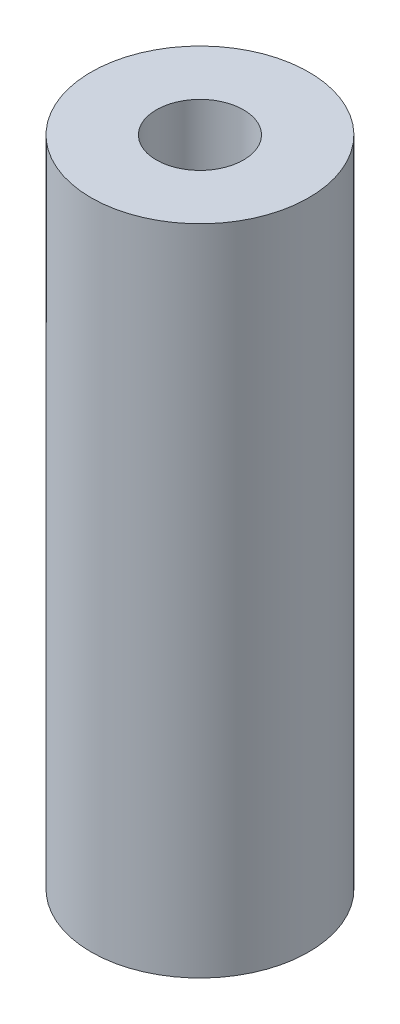
ISO-10303-21;
HEADER;
FILE_DESCRIPTION(('STEP AP214'),'2;1');
FILE_NAME('part.step','',(''),(''),'','','');
FILE_SCHEMA(('AUTOMOTIVE_DESIGN { 1 0 10303 214 1 1 1 1 }'));
ENDSEC;
DATA;
#1=APPLICATION_CONTEXT('core data for automotive mechanical design processes');
#2=APPLICATION_PROTOCOL_DEFINITION('international standard','automotive_design',2000,#1);
#3=PRODUCT_CONTEXT('',#1,'mechanical');
#4=PRODUCT('Part','Part','',(#3));
#5=PRODUCT_RELATED_PRODUCT_CATEGORY('part','',(#4));
#6=PRODUCT_DEFINITION_FORMATION('','',#4);
#7=PRODUCT_DEFINITION_CONTEXT('part definition',#1,'design');
#8=PRODUCT_DEFINITION('design','',#6,#7);
#9=PRODUCT_DEFINITION_SHAPE('','',#8);
#10=(LENGTH_UNIT() NAMED_UNIT(*) SI_UNIT(.MILLI.,.METRE.));
#11=(NAMED_UNIT(*) PLANE_ANGLE_UNIT() SI_UNIT($,.RADIAN.));
#12=(NAMED_UNIT(*) SI_UNIT($,.STERADIAN.) SOLID_ANGLE_UNIT());
#13=UNCERTAINTY_MEASURE_WITH_UNIT(LENGTH_MEASURE(1.E-05),#10,'distance_accuracy_value','');
#14=(GEOMETRIC_REPRESENTATION_CONTEXT(3) GLOBAL_UNCERTAINTY_ASSIGNED_CONTEXT((#13)) GLOBAL_UNIT_ASSIGNED_CONTEXT((#10,
#11,#12)) REPRESENTATION_CONTEXT('',''));
#15=CARTESIAN_POINT('',(0.,0.,0.));
#16=DIRECTION('',(0.,0.,1.));
#17=DIRECTION('',(1.,0.,0.));
#18=AXIS2_PLACEMENT_3D('',#15,#16,#17);
#19=CARTESIAN_POINT('',(0.,19.05,0.));
#20=DIRECTION('',(0.,1.,0.));
#21=DIRECTION('',(0.,0.,1.));
#22=AXIS2_PLACEMENT_3D('',#19,#20,#21);
#23=PLANE('',#22);
#24=CARTESIAN_POINT('',(0.,19.05,0.));
#25=DIRECTION('',(0.,1.,0.));
#26=DIRECTION('',(0.,0.,1.));
#27=AXIS2_PLACEMENT_3D('',#24,#25,#26);
#28=CIRCLE('',#27,3.175);
#29=CARTESIAN_POINT('',(0.,19.05,3.175));
#30=VERTEX_POINT('',#29);
#31=EDGE_CURVE('E10',#30,#30,#28,.T.);
#32=ORIENTED_EDGE('',*,*,#31,.T.);
#33=EDGE_LOOP('',(#32));
#34=FACE_BOUND('',#33,.T.);
#35=CARTESIAN_POINT('',(0.,19.05,0.));
#36=DIRECTION('',(0.,1.,0.));
#37=DIRECTION('',(0.,0.,1.));
#38=AXIS2_PLACEMENT_3D('',#35,#36,#37);
#39=CIRCLE('',#38,1.27);
#40=CARTESIAN_POINT('',(0.,19.05,1.27));
#41=VERTEX_POINT('',#40);
#42=EDGE_CURVE('E46',#41,#41,#39,.T.);
#43=ORIENTED_EDGE('',*,*,#42,.F.);
#44=EDGE_LOOP('',(#43));
#45=FACE_BOUND('',#44,.T.);
#46=ADVANCED_FACE('F35',(#34,#45),#23,.T.);
#47=CARTESIAN_POINT('',(0.,0.,0.));
#48=DIRECTION('',(0.,1.,0.));
#49=DIRECTION('',(0.,0.,1.));
#50=AXIS2_PLACEMENT_3D('',#47,#48,#49);
#51=PLANE('',#50);
#52=CARTESIAN_POINT('',(0.,0.,0.));
#53=DIRECTION('',(0.,1.,0.));
#54=DIRECTION('',(0.,0.,1.));
#55=AXIS2_PLACEMENT_3D('',#52,#53,#54);
#56=CIRCLE('',#55,3.175);
#57=CARTESIAN_POINT('',(0.,0.,3.175));
#58=VERTEX_POINT('',#57);
#59=EDGE_CURVE('E39',#58,#58,#56,.T.);
#60=ORIENTED_EDGE('',*,*,#59,.F.);
#61=EDGE_LOOP('',(#60));
#62=FACE_BOUND('',#61,.T.);
#63=CARTESIAN_POINT('',(0.,0.,0.));
#64=DIRECTION('',(0.,1.,0.));
#65=DIRECTION('',(0.,0.,1.));
#66=AXIS2_PLACEMENT_3D('',#63,#64,#65);
#67=CIRCLE('',#66,1.27);
#68=CARTESIAN_POINT('',(0.,0.,1.27));
#69=VERTEX_POINT('',#68);
#70=EDGE_CURVE('E48',#69,#69,#67,.T.);
#71=ORIENTED_EDGE('',*,*,#70,.T.);
#72=EDGE_LOOP('',(#71));
#73=FACE_BOUND('',#72,.T.);
#74=ADVANCED_FACE('F58',(#62,#73),#51,.F.);
#75=CARTESIAN_POINT('',(0.,19.05,0.));
#76=DIRECTION('',(0.,-1.,0.));
#77=DIRECTION('',(0.,0.,-1.));
#78=AXIS2_PLACEMENT_3D('',#75,#76,#77);
#79=CYLINDRICAL_SURFACE('',#78,3.175);
#80=ORIENTED_EDGE('',*,*,#31,.F.);
#81=EDGE_LOOP('',(#80));
#82=FACE_BOUND('',#81,.T.);
#83=ORIENTED_EDGE('',*,*,#59,.T.);
#84=EDGE_LOOP('',(#83));
#85=FACE_BOUND('',#84,.T.);
#86=ADVANCED_FACE('F37',(#82,#85),#79,.T.);
#87=CARTESIAN_POINT('',(0.,19.05,0.));
#88=DIRECTION('',(0.,-1.,0.));
#89=DIRECTION('',(0.,0.,-1.));
#90=AXIS2_PLACEMENT_3D('',#87,#88,#89);
#91=CYLINDRICAL_SURFACE('',#90,1.27);
#92=ORIENTED_EDGE('',*,*,#42,.T.);
#93=EDGE_LOOP('',(#92));
#94=FACE_BOUND('',#93,.T.);
#95=ORIENTED_EDGE('',*,*,#70,.F.);
#96=EDGE_LOOP('',(#95));
#97=FACE_BOUND('',#96,.T.);
#98=ADVANCED_FACE('F54',(#94,#97),#91,.F.);
#99=CLOSED_SHELL('',(#46,#74,#86,#98));
#100=MANIFOLD_SOLID_BREP('B2',#99);
#101=ADVANCED_BREP_SHAPE_REPRESENTATION('',(#18,#100),#14);
#102=SHAPE_DEFINITION_REPRESENTATION(#9,#101);
ENDSEC;
END-ISO-10303-21;
